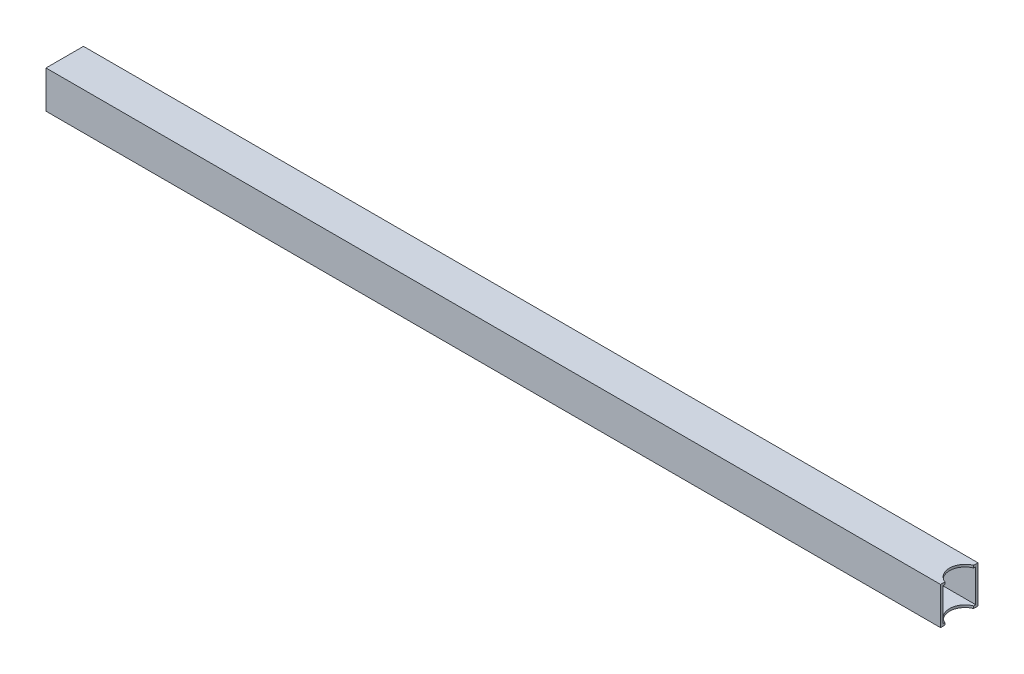
ISO-10303-21;
HEADER;
FILE_DESCRIPTION(('STEP AP214'),'2;1');
FILE_NAME('part.step','',(''),(''),'','','');
FILE_SCHEMA(('AUTOMOTIVE_DESIGN { 1 0 10303 214 1 1 1 1 }'));
ENDSEC;
DATA;
#1=APPLICATION_CONTEXT('core data for automotive mechanical design processes');
#2=APPLICATION_PROTOCOL_DEFINITION('international standard','automotive_design',2000,#1);
#3=PRODUCT_CONTEXT('',#1,'mechanical');
#4=PRODUCT('Part','Part','',(#3));
#5=PRODUCT_RELATED_PRODUCT_CATEGORY('part','',(#4));
#6=PRODUCT_DEFINITION_FORMATION('','',#4);
#7=PRODUCT_DEFINITION_CONTEXT('part definition',#1,'design');
#8=PRODUCT_DEFINITION('design','',#6,#7);
#9=PRODUCT_DEFINITION_SHAPE('','',#8);
#10=(LENGTH_UNIT() NAMED_UNIT(*) SI_UNIT(.MILLI.,.METRE.));
#11=(NAMED_UNIT(*) PLANE_ANGLE_UNIT() SI_UNIT($,.RADIAN.));
#12=(NAMED_UNIT(*) SI_UNIT($,.STERADIAN.) SOLID_ANGLE_UNIT());
#13=UNCERTAINTY_MEASURE_WITH_UNIT(LENGTH_MEASURE(1.E-05),#10,'distance_accuracy_value','');
#14=(GEOMETRIC_REPRESENTATION_CONTEXT(3) GLOBAL_UNCERTAINTY_ASSIGNED_CONTEXT((#13)) GLOBAL_UNIT_ASSIGNED_CONTEXT((#10,
#11,#12)) REPRESENTATION_CONTEXT('',''));
#15=CARTESIAN_POINT('',(0.,0.,0.));
#16=DIRECTION('',(0.,0.,1.));
#17=DIRECTION('',(1.,0.,0.));
#18=AXIS2_PLACEMENT_3D('',#15,#16,#17);
#19=CARTESIAN_POINT('',(622.3,1.66533453693773E-12,0.));
#20=DIRECTION('',(1.,0.,0.));
#21=DIRECTION('',(0.,0.,-1.));
#22=AXIS2_PLACEMENT_3D('',#19,#20,#21);
#23=PLANE('',#22);
#24=DIRECTION('',(0.,1.00000000000001,0.));
#25=VECTOR('',#24,1.);
#26=CARTESIAN_POINT('',(622.3,-25.3999999999987,-19.5306635255949));
#27=LINE('',#26,#25);
#28=CARTESIAN_POINT('',(622.3,-25.3999999999987,-19.5306635255949));
#29=VERTEX_POINT('',#28);
#30=CARTESIAN_POINT('',(622.3,-22.2249999999986,-19.5306635255949));
#31=VERTEX_POINT('',#30);
#32=EDGE_CURVE('E11',#29,#31,#27,.T.);
#33=ORIENTED_EDGE('',*,*,#32,.F.);
#34=DIRECTION('',(0.,0.,-1.));
#35=VECTOR('',#34,1.);
#36=CARTESIAN_POINT('',(622.3,-25.3999999999987,25.4));
#37=LINE('',#36,#35);
#38=CARTESIAN_POINT('',(622.3,-25.3999999999987,-25.4));
#39=VERTEX_POINT('',#38);
#40=EDGE_CURVE('E245',#29,#39,#37,.T.);
#41=ORIENTED_EDGE('',*,*,#40,.T.);
#42=DIRECTION('',(0.,1.00000000000001,0.));
#43=VECTOR('',#42,1.);
#44=CARTESIAN_POINT('',(622.3,-25.3999999999987,-25.4));
#45=LINE('',#44,#43);
#46=CARTESIAN_POINT('',(622.3,25.400000000002,-25.4));
#47=VERTEX_POINT('',#46);
#48=EDGE_CURVE('E149',#39,#47,#45,.T.);
#49=ORIENTED_EDGE('',*,*,#48,.T.);
#50=DIRECTION('',(0.,0.,1.));
#51=VECTOR('',#50,1.);
#52=CARTESIAN_POINT('',(622.3,25.400000000002,-25.4));
#53=LINE('',#52,#51);
#54=CARTESIAN_POINT('',(622.3,25.400000000002,-19.5306635255949));
#55=VERTEX_POINT('',#54);
#56=EDGE_CURVE('E140',#47,#55,#53,.T.);
#57=ORIENTED_EDGE('',*,*,#56,.T.);
#58=CARTESIAN_POINT('',(622.3,22.225000000002,-19.5306635255949));
#59=VERTEX_POINT('',#58);
#60=EDGE_CURVE('E44',#59,#55,#27,.T.);
#61=ORIENTED_EDGE('',*,*,#60,.F.);
#62=DIRECTION('',(0.,0.,1.));
#63=VECTOR('',#62,1.);
#64=CARTESIAN_POINT('',(622.3,22.225000000002,-22.225));
#65=LINE('',#64,#63);
#66=CARTESIAN_POINT('',(622.3,22.225000000002,-22.225));
#67=VERTEX_POINT('',#66);
#68=EDGE_CURVE('E231',#67,#59,#65,.T.);
#69=ORIENTED_EDGE('',*,*,#68,.F.);
#70=DIRECTION('',(0.,1.00000000000001,0.));
#71=VECTOR('',#70,1.);
#72=CARTESIAN_POINT('',(622.3,-22.2249999999986,-22.225));
#73=LINE('',#72,#71);
#74=CARTESIAN_POINT('',(622.3,-22.2249999999986,-22.225));
#75=VERTEX_POINT('',#74);
#76=EDGE_CURVE('E240',#75,#67,#73,.T.);
#77=ORIENTED_EDGE('',*,*,#76,.F.);
#78=DIRECTION('',(0.,0.,-1.));
#79=VECTOR('',#78,1.);
#80=CARTESIAN_POINT('',(622.3,-22.2249999999986,22.225));
#81=LINE('',#80,#79);
#82=EDGE_CURVE('E279',#31,#75,#81,.T.);
#83=ORIENTED_EDGE('',*,*,#82,.F.);
#84=EDGE_LOOP('',(#33,#41,#49,#57,#61,#69,#77,#83));
#85=FACE_BOUND('',#84,.T.);
#86=ADVANCED_FACE('F40',(#85),#23,.T.);
#87=CARTESIAN_POINT('',(-590.55,-25.4000000000019,-25.4));
#88=DIRECTION('',(0.,0.,-1.));
#89=DIRECTION('',(-1.,0.,0.));
#90=AXIS2_PLACEMENT_3D('',#87,#88,#89);
#91=PLANE('',#90);
#92=DIRECTION('',(1.,0.,0.));
#93=VECTOR('',#92,1.);
#94=CARTESIAN_POINT('',(-590.55,25.3999999999987,-25.4));
#95=LINE('',#94,#93);
#96=CARTESIAN_POINT('',(-590.55,25.3999999999987,-25.4));
#97=VERTEX_POINT('',#96);
#98=EDGE_CURVE('E207',#97,#47,#95,.T.);
#99=ORIENTED_EDGE('',*,*,#98,.T.);
#100=ORIENTED_EDGE('',*,*,#48,.F.);
#101=DIRECTION('',(1.,0.,0.));
#102=VECTOR('',#101,1.);
#103=CARTESIAN_POINT('',(-590.55,-25.4000000000019,-25.4));
#104=LINE('',#103,#102);
#105=CARTESIAN_POINT('',(-590.55,-25.4000000000019,-25.4));
#106=VERTEX_POINT('',#105);
#107=EDGE_CURVE('E208',#106,#39,#104,.T.);
#108=ORIENTED_EDGE('',*,*,#107,.F.);
#109=DIRECTION('',(0.,1.00000000000001,0.));
#110=VECTOR('',#109,1.);
#111=CARTESIAN_POINT('',(-590.55,-25.4000000000019,-25.4));
#112=LINE('',#111,#110);
#113=EDGE_CURVE('E182',#106,#97,#112,.T.);
#114=ORIENTED_EDGE('',*,*,#113,.T.);
#115=EDGE_LOOP('',(#99,#100,#108,#114));
#116=FACE_BOUND('',#115,.T.);
#117=ADVANCED_FACE('F42',(#116),#91,.T.);
#118=CARTESIAN_POINT('',(-590.55,-25.4000000000019,25.4));
#119=DIRECTION('',(0.,-1.00000000000001,0.));
#120=DIRECTION('',(0.,0.,-1.));
#121=AXIS2_PLACEMENT_3D('',#118,#119,#120);
#122=PLANE('',#121);
#123=CARTESIAN_POINT('',(630.2375,-25.3999999999987,0.));
#124=DIRECTION('',(0.,1.00000000000001,0.));
#125=DIRECTION('',(0.,0.,1.));
#126=AXIS2_PLACEMENT_3D('',#123,#124,#125);
#127=CIRCLE('',#126,21.0820000000001);
#128=CARTESIAN_POINT('',(622.3,-25.3999999999987,19.5306635255949));
#129=VERTEX_POINT('',#128);
#130=EDGE_CURVE('E144',#29,#129,#127,.T.);
#131=ORIENTED_EDGE('',*,*,#130,.T.);
#132=CARTESIAN_POINT('',(622.3,-25.3999999999987,25.4));
#133=VERTEX_POINT('',#132);
#134=EDGE_CURVE('E250',#133,#129,#37,.T.);
#135=ORIENTED_EDGE('',*,*,#134,.F.);
#136=DIRECTION('',(1.,0.,0.));
#137=VECTOR('',#136,1.);
#138=CARTESIAN_POINT('',(-590.55,-25.4000000000019,25.4));
#139=LINE('',#138,#137);
#140=CARTESIAN_POINT('',(-590.55,-25.4000000000019,25.4));
#141=VERTEX_POINT('',#140);
#142=EDGE_CURVE('E213',#141,#133,#139,.T.);
#143=ORIENTED_EDGE('',*,*,#142,.F.);
#144=DIRECTION('',(0.,0.,-1.));
#145=VECTOR('',#144,1.);
#146=CARTESIAN_POINT('',(-590.55,-25.4000000000019,25.4));
#147=LINE('',#146,#145);
#148=EDGE_CURVE('E203',#141,#106,#147,.T.);
#149=ORIENTED_EDGE('',*,*,#148,.T.);
#150=ORIENTED_EDGE('',*,*,#107,.T.);
#151=ORIENTED_EDGE('',*,*,#40,.F.);
#152=EDGE_LOOP('',(#131,#135,#143,#149,#150,#151));
#153=FACE_BOUND('',#152,.T.);
#154=ADVANCED_FACE('F261',(#153),#122,.T.);
#155=CARTESIAN_POINT('',(-590.55,-25.4000000000019,25.4));
#156=DIRECTION('',(0.,0.,1.));
#157=DIRECTION('',(1.,0.,0.));
#158=AXIS2_PLACEMENT_3D('',#155,#156,#157);
#159=PLANE('',#158);
#160=ORIENTED_EDGE('',*,*,#142,.T.);
#161=DIRECTION('',(0.,-1.00000000000001,0.));
#162=VECTOR('',#161,1.);
#163=CARTESIAN_POINT('',(622.3,25.400000000002,25.4));
#164=LINE('',#163,#162);
#165=CARTESIAN_POINT('',(622.3,25.400000000002,25.4));
#166=VERTEX_POINT('',#165);
#167=EDGE_CURVE('E151',#166,#133,#164,.T.);
#168=ORIENTED_EDGE('',*,*,#167,.F.);
#169=DIRECTION('',(1.,0.,0.));
#170=VECTOR('',#169,1.);
#171=CARTESIAN_POINT('',(-590.55,25.3999999999987,25.4));
#172=LINE('',#171,#170);
#173=CARTESIAN_POINT('',(-590.55,25.3999999999987,25.4));
#174=VERTEX_POINT('',#173);
#175=EDGE_CURVE('E216',#174,#166,#172,.T.);
#176=ORIENTED_EDGE('',*,*,#175,.F.);
#177=DIRECTION('',(0.,-1.00000000000001,0.));
#178=VECTOR('',#177,1.);
#179=CARTESIAN_POINT('',(-590.55,-25.4000000000019,25.4));
#180=LINE('',#179,#178);
#181=EDGE_CURVE('E199',#174,#141,#180,.T.);
#182=ORIENTED_EDGE('',*,*,#181,.T.);
#183=EDGE_LOOP('',(#160,#168,#176,#182));
#184=FACE_BOUND('',#183,.T.);
#185=ADVANCED_FACE('F270',(#184),#159,.T.);
#186=CARTESIAN_POINT('',(-590.55,25.3999999999987,25.4));
#187=DIRECTION('',(0.,1.00000000000001,0.));
#188=DIRECTION('',(0.,0.,1.));
#189=AXIS2_PLACEMENT_3D('',#186,#187,#188);
#190=PLANE('',#189);
#191=CARTESIAN_POINT('',(630.2375,25.400000000002,0.));
#192=DIRECTION('',(0.,1.00000000000001,0.));
#193=DIRECTION('',(0.,0.,1.));
#194=AXIS2_PLACEMENT_3D('',#191,#192,#193);
#195=CIRCLE('',#194,21.0820000000001);
#196=CARTESIAN_POINT('',(622.3,25.400000000002,19.5306635255949));
#197=VERTEX_POINT('',#196);
#198=EDGE_CURVE('E63',#55,#197,#195,.T.);
#199=ORIENTED_EDGE('',*,*,#198,.F.);
#200=ORIENTED_EDGE('',*,*,#56,.F.);
#201=ORIENTED_EDGE('',*,*,#98,.F.);
#202=DIRECTION('',(0.,0.,1.));
#203=VECTOR('',#202,1.);
#204=CARTESIAN_POINT('',(-590.55,25.3999999999987,25.4));
#205=LINE('',#204,#203);
#206=EDGE_CURVE('E195',#97,#174,#205,.T.);
#207=ORIENTED_EDGE('',*,*,#206,.T.);
#208=ORIENTED_EDGE('',*,*,#175,.T.);
#209=EDGE_CURVE('E142',#197,#166,#53,.T.);
#210=ORIENTED_EDGE('',*,*,#209,.F.);
#211=EDGE_LOOP('',(#199,#200,#201,#207,#208,#210));
#212=FACE_BOUND('',#211,.T.);
#213=ADVANCED_FACE('F139',(#212),#190,.T.);
#214=CARTESIAN_POINT('',(-590.55,-1.58206781009085E-12,0.));
#215=DIRECTION('',(-1.,0.,0.));
#216=DIRECTION('',(0.,0.,1.));
#217=AXIS2_PLACEMENT_3D('',#214,#215,#216);
#218=PLANE('',#217);
#219=DIRECTION('',(0.,1.00000000000001,0.));
#220=VECTOR('',#219,1.);
#221=CARTESIAN_POINT('',(-590.55,-22.2250000000018,-22.225));
#222=LINE('',#221,#220);
#223=CARTESIAN_POINT('',(-590.55,-22.2250000000018,-22.225));
#224=VERTEX_POINT('',#223);
#225=CARTESIAN_POINT('',(-590.55,22.2249999999987,-22.225));
#226=VERTEX_POINT('',#225);
#227=EDGE_CURVE('E157',#224,#226,#222,.T.);
#228=ORIENTED_EDGE('',*,*,#227,.T.);
#229=DIRECTION('',(0.,0.,1.));
#230=VECTOR('',#229,1.);
#231=CARTESIAN_POINT('',(-590.55,22.2249999999987,22.225));
#232=LINE('',#231,#230);
#233=CARTESIAN_POINT('',(-590.55,22.2249999999987,22.225));
#234=VERTEX_POINT('',#233);
#235=EDGE_CURVE('E165',#226,#234,#232,.T.);
#236=ORIENTED_EDGE('',*,*,#235,.T.);
#237=DIRECTION('',(0.,-1.00000000000001,0.));
#238=VECTOR('',#237,1.);
#239=CARTESIAN_POINT('',(-590.55,-22.2250000000018,22.225));
#240=LINE('',#239,#238);
#241=CARTESIAN_POINT('',(-590.55,-22.2250000000018,22.225));
#242=VERTEX_POINT('',#241);
#243=EDGE_CURVE('E169',#234,#242,#240,.T.);
#244=ORIENTED_EDGE('',*,*,#243,.T.);
#245=DIRECTION('',(0.,0.,-1.));
#246=VECTOR('',#245,1.);
#247=CARTESIAN_POINT('',(-590.55,-22.2250000000018,22.225));
#248=LINE('',#247,#246);
#249=EDGE_CURVE('E173',#242,#224,#248,.T.);
#250=ORIENTED_EDGE('',*,*,#249,.T.);
#251=EDGE_LOOP('',(#228,#236,#244,#250));
#252=FACE_BOUND('',#251,.T.);
#253=ORIENTED_EDGE('',*,*,#113,.F.);
#254=ORIENTED_EDGE('',*,*,#148,.F.);
#255=ORIENTED_EDGE('',*,*,#181,.F.);
#256=ORIENTED_EDGE('',*,*,#206,.F.);
#257=EDGE_LOOP('',(#253,#254,#255,#256));
#258=FACE_BOUND('',#257,.T.);
#259=ADVANCED_FACE('F268',(#252,#258),#218,.T.);
#260=CARTESIAN_POINT('',(-590.55,-22.2250000000018,-22.225));
#261=DIRECTION('',(0.,0.,-1.));
#262=DIRECTION('',(-1.,0.,0.));
#263=AXIS2_PLACEMENT_3D('',#260,#261,#262);
#264=PLANE('',#263);
#265=DIRECTION('',(1.,0.,0.));
#266=VECTOR('',#265,1.);
#267=CARTESIAN_POINT('',(-590.55,-22.2250000000018,-22.225));
#268=LINE('',#267,#266);
#269=EDGE_CURVE('E178',#224,#75,#268,.T.);
#270=ORIENTED_EDGE('',*,*,#269,.T.);
#271=ORIENTED_EDGE('',*,*,#76,.T.);
#272=DIRECTION('',(1.,0.,0.));
#273=VECTOR('',#272,1.);
#274=CARTESIAN_POINT('',(-590.55,22.2249999999987,-22.225));
#275=LINE('',#274,#273);
#276=EDGE_CURVE('E177',#226,#67,#275,.T.);
#277=ORIENTED_EDGE('',*,*,#276,.F.);
#278=ORIENTED_EDGE('',*,*,#227,.F.);
#279=EDGE_LOOP('',(#270,#271,#277,#278));
#280=FACE_BOUND('',#279,.T.);
#281=ADVANCED_FACE('F291',(#280),#264,.F.);
#282=CARTESIAN_POINT('',(-590.55,-22.2250000000018,22.225));
#283=DIRECTION('',(0.,-1.00000000000001,0.));
#284=DIRECTION('',(0.,0.,-1.));
#285=AXIS2_PLACEMENT_3D('',#282,#283,#284);
#286=PLANE('',#285);
#287=CARTESIAN_POINT('',(622.3,-22.2249999999986,22.225));
#288=VERTEX_POINT('',#287);
#289=CARTESIAN_POINT('',(622.3,-22.2249999999986,19.5306635255949));
#290=VERTEX_POINT('',#289);
#291=EDGE_CURVE('E247',#288,#290,#81,.T.);
#292=ORIENTED_EDGE('',*,*,#291,.T.);
#293=CARTESIAN_POINT('',(630.2375,-22.2249999999986,0.));
#294=DIRECTION('',(0.,-1.00000000000001,0.));
#295=DIRECTION('',(0.,0.,-1.));
#296=AXIS2_PLACEMENT_3D('',#293,#294,#295);
#297=CIRCLE('',#296,21.0820000000001);
#298=EDGE_CURVE('E55',#290,#31,#297,.T.);
#299=ORIENTED_EDGE('',*,*,#298,.T.);
#300=ORIENTED_EDGE('',*,*,#82,.T.);
#301=ORIENTED_EDGE('',*,*,#269,.F.);
#302=ORIENTED_EDGE('',*,*,#249,.F.);
#303=DIRECTION('',(1.,0.,0.));
#304=VECTOR('',#303,1.);
#305=CARTESIAN_POINT('',(-590.55,-22.2250000000018,22.225));
#306=LINE('',#305,#304);
#307=EDGE_CURVE('E183',#242,#288,#306,.T.);
#308=ORIENTED_EDGE('',*,*,#307,.T.);
#309=EDGE_LOOP('',(#292,#299,#300,#301,#302,#308));
#310=FACE_BOUND('',#309,.T.);
#311=ADVANCED_FACE('F286',(#310),#286,.F.);
#312=CARTESIAN_POINT('',(-590.55,-22.2250000000018,22.225));
#313=DIRECTION('',(0.,0.,1.));
#314=DIRECTION('',(1.,0.,0.));
#315=AXIS2_PLACEMENT_3D('',#312,#313,#314);
#316=PLANE('',#315);
#317=DIRECTION('',(1.,0.,0.));
#318=VECTOR('',#317,1.);
#319=CARTESIAN_POINT('',(-590.55,22.2249999999987,22.225));
#320=LINE('',#319,#318);
#321=CARTESIAN_POINT('',(622.3,22.225000000002,22.225));
#322=VERTEX_POINT('',#321);
#323=EDGE_CURVE('E186',#234,#322,#320,.T.);
#324=ORIENTED_EDGE('',*,*,#323,.T.);
#325=DIRECTION('',(0.,-1.00000000000001,0.));
#326=VECTOR('',#325,1.);
#327=CARTESIAN_POINT('',(622.3,22.225000000002,22.225));
#328=LINE('',#327,#326);
#329=EDGE_CURVE('E233',#322,#288,#328,.T.);
#330=ORIENTED_EDGE('',*,*,#329,.T.);
#331=ORIENTED_EDGE('',*,*,#307,.F.);
#332=ORIENTED_EDGE('',*,*,#243,.F.);
#333=EDGE_LOOP('',(#324,#330,#331,#332));
#334=FACE_BOUND('',#333,.T.);
#335=ADVANCED_FACE('F295',(#334),#316,.F.);
#336=CARTESIAN_POINT('',(-590.55,22.2249999999987,22.225));
#337=DIRECTION('',(0.,1.00000000000001,0.));
#338=DIRECTION('',(0.,0.,1.));
#339=AXIS2_PLACEMENT_3D('',#336,#337,#338);
#340=PLANE('',#339);
#341=ORIENTED_EDGE('',*,*,#68,.T.);
#342=CARTESIAN_POINT('',(630.2375,22.225000000002,0.));
#343=DIRECTION('',(0.,1.00000000000001,0.));
#344=DIRECTION('',(0.,0.,1.));
#345=AXIS2_PLACEMENT_3D('',#342,#343,#344);
#346=CIRCLE('',#345,21.0820000000001);
#347=CARTESIAN_POINT('',(622.3,22.225000000002,19.5306635255949));
#348=VERTEX_POINT('',#347);
#349=EDGE_CURVE('E129',#59,#348,#346,.T.);
#350=ORIENTED_EDGE('',*,*,#349,.T.);
#351=EDGE_CURVE('E230',#348,#322,#65,.T.);
#352=ORIENTED_EDGE('',*,*,#351,.T.);
#353=ORIENTED_EDGE('',*,*,#323,.F.);
#354=ORIENTED_EDGE('',*,*,#235,.F.);
#355=ORIENTED_EDGE('',*,*,#276,.T.);
#356=EDGE_LOOP('',(#341,#350,#352,#353,#354,#355));
#357=FACE_BOUND('',#356,.T.);
#358=ADVANCED_FACE('F228',(#357),#340,.F.);
#359=DIRECTION('',(0.,1.00000000000001,0.));
#360=VECTOR('',#359,1.);
#361=CARTESIAN_POINT('',(622.3,-25.3999999999987,19.5306635255949));
#362=LINE('',#361,#360);
#363=EDGE_CURVE('E135',#197,#348,#362,.F.);
#364=ORIENTED_EDGE('',*,*,#363,.F.);
#365=ORIENTED_EDGE('',*,*,#209,.T.);
#366=ORIENTED_EDGE('',*,*,#167,.T.);
#367=ORIENTED_EDGE('',*,*,#134,.T.);
#368=EDGE_CURVE('E212',#290,#129,#362,.F.);
#369=ORIENTED_EDGE('',*,*,#368,.F.);
#370=ORIENTED_EDGE('',*,*,#291,.F.);
#371=ORIENTED_EDGE('',*,*,#329,.F.);
#372=ORIENTED_EDGE('',*,*,#351,.F.);
#373=EDGE_LOOP('',(#364,#365,#366,#367,#369,#370,#371,#372));
#374=FACE_BOUND('',#373,.T.);
#375=ADVANCED_FACE('F236',(#374),#23,.T.);
#376=CARTESIAN_POINT('',(630.2375,-25.3999999999987,0.));
#377=DIRECTION('',(0.,1.00000000000001,0.));
#378=DIRECTION('',(0.,0.,1.));
#379=AXIS2_PLACEMENT_3D('',#376,#377,#378);
#380=CYLINDRICAL_SURFACE('',#379,21.0820000000001);
#381=ORIENTED_EDGE('',*,*,#32,.T.);
#382=ORIENTED_EDGE('',*,*,#298,.F.);
#383=ORIENTED_EDGE('',*,*,#368,.T.);
#384=ORIENTED_EDGE('',*,*,#130,.F.);
#385=EDGE_LOOP('',(#381,#382,#383,#384));
#386=FACE_BOUND('',#385,.T.);
#387=ADVANCED_FACE('F311',(#386),#380,.F.);
#388=ORIENTED_EDGE('',*,*,#60,.T.);
#389=ORIENTED_EDGE('',*,*,#198,.T.);
#390=ORIENTED_EDGE('',*,*,#363,.T.);
#391=ORIENTED_EDGE('',*,*,#349,.F.);
#392=EDGE_LOOP('',(#388,#389,#390,#391));
#393=FACE_BOUND('',#392,.T.);
#394=ADVANCED_FACE('F127',(#393),#380,.F.);
#395=CLOSED_SHELL('',(#86,#117,#154,#185,#213,#259,#281,#311,#335,#358,#375,#387,#394));
#396=MANIFOLD_SOLID_BREP('B2',#395);
#397=ADVANCED_BREP_SHAPE_REPRESENTATION('',(#18,#396),#14);
#398=SHAPE_DEFINITION_REPRESENTATION(#9,#397);
ENDSEC;
END-ISO-10303-21;
